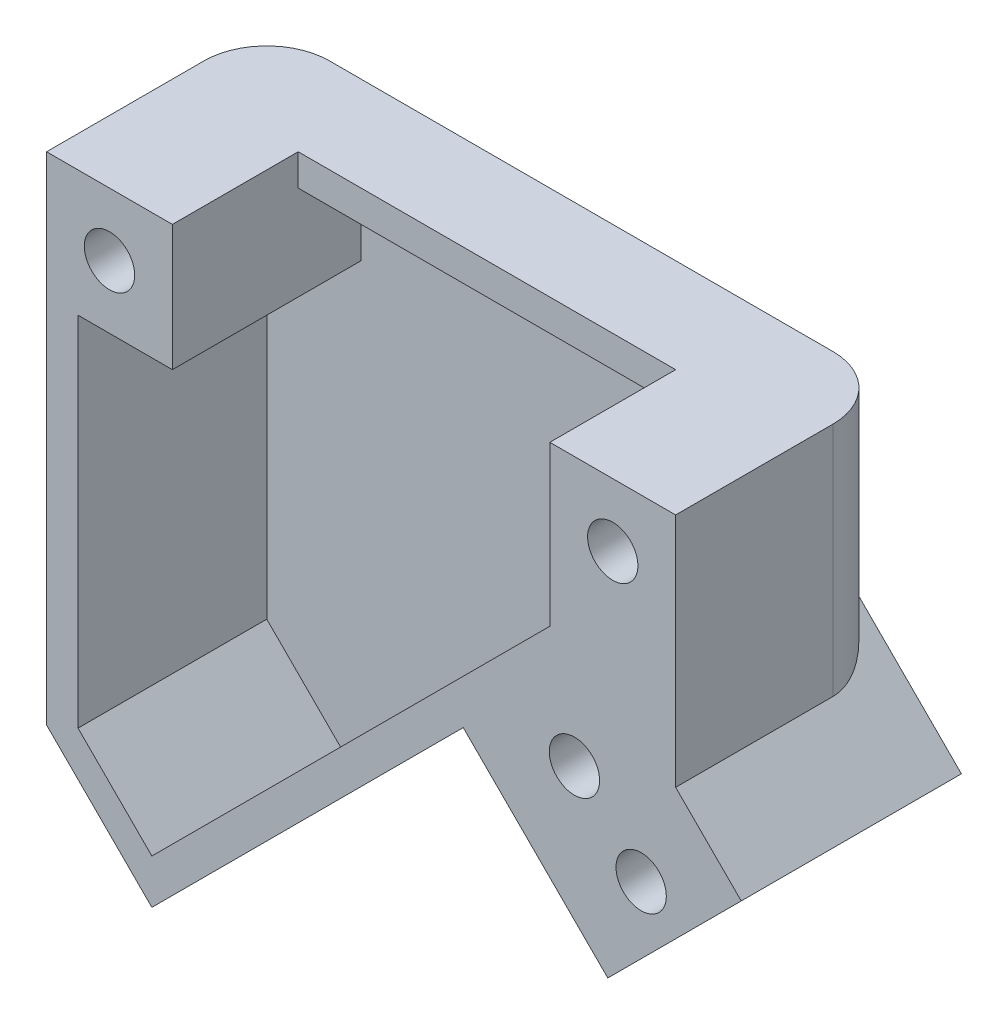
ISO-10303-21;
HEADER;
FILE_DESCRIPTION(('STEP AP214'),'2;1');
FILE_NAME('part.step','',(''),(''),'','','');
FILE_SCHEMA(('AUTOMOTIVE_DESIGN { 1 0 10303 214 1 1 1 1 }'));
ENDSEC;
DATA;
#1=APPLICATION_CONTEXT('core data for automotive mechanical design processes');
#2=APPLICATION_PROTOCOL_DEFINITION('international standard','automotive_design',2000,#1);
#3=PRODUCT_CONTEXT('',#1,'mechanical');
#4=PRODUCT('Part','Part','',(#3));
#5=PRODUCT_RELATED_PRODUCT_CATEGORY('part','',(#4));
#6=PRODUCT_DEFINITION_FORMATION('','',#4);
#7=PRODUCT_DEFINITION_CONTEXT('part definition',#1,'design');
#8=PRODUCT_DEFINITION('design','',#6,#7);
#9=PRODUCT_DEFINITION_SHAPE('','',#8);
#10=(LENGTH_UNIT() NAMED_UNIT(*) SI_UNIT(.MILLI.,.METRE.));
#11=(NAMED_UNIT(*) PLANE_ANGLE_UNIT() SI_UNIT($,.RADIAN.));
#12=(NAMED_UNIT(*) SI_UNIT($,.STERADIAN.) SOLID_ANGLE_UNIT());
#13=UNCERTAINTY_MEASURE_WITH_UNIT(LENGTH_MEASURE(1.E-05),#10,'distance_accuracy_value','');
#14=(GEOMETRIC_REPRESENTATION_CONTEXT(3) GLOBAL_UNCERTAINTY_ASSIGNED_CONTEXT((#13)) GLOBAL_UNIT_ASSIGNED_CONTEXT((#10,
#11,#12)) REPRESENTATION_CONTEXT('',''));
#15=CARTESIAN_POINT('',(0.,0.,0.));
#16=DIRECTION('',(0.,0.,1.));
#17=DIRECTION('',(1.,0.,0.));
#18=AXIS2_PLACEMENT_3D('',#15,#16,#17);
#19=CARTESIAN_POINT('',(0.,0.,7.));
#20=DIRECTION('',(0.,0.,1.));
#21=DIRECTION('',(1.,0.,0.));
#22=AXIS2_PLACEMENT_3D('',#19,#20,#21);
#23=PLANE('',#22);
#24=DIRECTION('',(0.,-1.,0.));
#25=VECTOR('',#24,1.);
#26=CARTESIAN_POINT('',(4.00000000000009,-1.,7.));
#27=LINE('',#26,#25);
#28=CARTESIAN_POINT('',(4.00000000000009,0.,7.));
#29=VERTEX_POINT('',#28);
#30=CARTESIAN_POINT('',(4.00000000000009,-4.,7.));
#31=VERTEX_POINT('',#30);
#32=EDGE_CURVE('E250',#29,#31,#27,.T.);
#33=ORIENTED_EDGE('',*,*,#32,.F.);
#34=DIRECTION('',(-1.,0.,0.));
#35=VECTOR('',#34,1.);
#36=CARTESIAN_POINT('',(0.,0.,7.));
#37=LINE('',#36,#35);
#38=CARTESIAN_POINT('',(0.,0.,7.));
#39=VERTEX_POINT('',#38);
#40=EDGE_CURVE('E282',#29,#39,#37,.T.);
#41=ORIENTED_EDGE('',*,*,#40,.T.);
#42=DIRECTION('',(0.,-1.,0.));
#43=VECTOR('',#42,1.);
#44=CARTESIAN_POINT('',(0.,0.,7.));
#45=LINE('',#44,#43);
#46=CARTESIAN_POINT('',(0.,-15.7842712456693,7.));
#47=VERTEX_POINT('',#46);
#48=EDGE_CURVE('E286',#39,#47,#45,.T.);
#49=ORIENTED_EDGE('',*,*,#48,.T.);
#50=DIRECTION('',(0.707106781186548,-0.707106781186548,0.));
#51=VECTOR('',#50,1.);
#52=CARTESIAN_POINT('',(3.34741725433348,-19.1316885000028,7.));
#53=LINE('',#52,#51);
#54=CARTESIAN_POINT('',(3.34741725433348,-19.1316885000028,7.));
#55=VERTEX_POINT('',#54);
#56=EDGE_CURVE('E288',#47,#55,#53,.T.);
#57=ORIENTED_EDGE('',*,*,#56,.T.);
#58=DIRECTION('',(0.707106781186548,0.707106781186548,0.));
#59=VECTOR('',#58,1.);
#60=CARTESIAN_POINT('',(13.2469121909451,-9.23219356339115,7.));
#61=LINE('',#60,#59);
#62=CARTESIAN_POINT('',(13.2469121909451,-9.23219356339115,7.));
#63=VERTEX_POINT('',#62);
#64=EDGE_CURVE('E290',#55,#63,#61,.T.);
#65=ORIENTED_EDGE('',*,*,#64,.T.);
#66=DIRECTION('',(0.707106781186548,-0.707106781186547,0.));
#67=VECTOR('',#66,1.);
#68=CARTESIAN_POINT('',(13.2469121909451,-9.23219356339115,7.));
#69=LINE('',#68,#67);
#70=CARTESIAN_POINT('',(17.8431062686601,-13.8283876411061,7.));
#71=VERTEX_POINT('',#70);
#72=EDGE_CURVE('E292',#63,#71,#69,.T.);
#73=ORIENTED_EDGE('',*,*,#72,.T.);
#74=DIRECTION('',(0.707106781186548,0.707106781186548,0.));
#75=VECTOR('',#74,1.);
#76=CARTESIAN_POINT('',(17.8431062686601,-13.8283876411061,7.));
#77=LINE('',#76,#75);
#78=CARTESIAN_POINT('',(22.0857469539857,-9.58574695578038,7.));
#79=VERTEX_POINT('',#78);
#80=EDGE_CURVE('E294',#71,#79,#77,.T.);
#81=ORIENTED_EDGE('',*,*,#80,.T.);
#82=DIRECTION('',(-0.707106781186547,0.707106781186547,0.));
#83=VECTOR('',#82,1.);
#84=CARTESIAN_POINT('',(22.0857469539857,-9.58574695578038,7.));
#85=LINE('',#84,#83);
#86=CARTESIAN_POINT('',(19.9999999982053,-7.49999999999991,7.));
#87=VERTEX_POINT('',#86);
#88=EDGE_CURVE('E296',#79,#87,#85,.T.);
#89=ORIENTED_EDGE('',*,*,#88,.T.);
#90=DIRECTION('',(0.,1.,0.));
#91=VECTOR('',#90,1.);
#92=CARTESIAN_POINT('',(19.9999999982053,0.,7.));
#93=LINE('',#92,#91);
#94=CARTESIAN_POINT('',(19.9999999982053,0.,7.));
#95=VERTEX_POINT('',#94);
#96=EDGE_CURVE('E279',#87,#95,#93,.T.);
#97=ORIENTED_EDGE('',*,*,#96,.T.);
#98=CARTESIAN_POINT('',(15.9999999982053,0.,7.));
#99=VERTEX_POINT('',#98);
#100=EDGE_CURVE('E284',#95,#99,#37,.T.);
#101=ORIENTED_EDGE('',*,*,#100,.T.);
#102=DIRECTION('',(0.,1.,0.));
#103=VECTOR('',#102,1.);
#104=CARTESIAN_POINT('',(15.9999999982053,-1.,7.));
#105=LINE('',#104,#103);
#106=CARTESIAN_POINT('',(15.9999999982053,-5.06489219196322,7.));
#107=VERTEX_POINT('',#106);
#108=EDGE_CURVE('E193',#107,#99,#105,.T.);
#109=ORIENTED_EDGE('',*,*,#108,.F.);
#110=DIRECTION('',(0.707106781186548,0.707106781186547,0.));
#111=VECTOR('',#110,1.);
#112=CARTESIAN_POINT('',(15.9999999982053,-5.06489219196322,7.));
#113=LINE('',#112,#111);
#114=CARTESIAN_POINT('',(3.34741725253877,-17.7174749376297,7.));
#115=VERTEX_POINT('',#114);
#116=EDGE_CURVE('E259',#115,#107,#113,.T.);
#117=ORIENTED_EDGE('',*,*,#116,.F.);
#118=DIRECTION('',(0.707106781186548,-0.707106781186548,0.));
#119=VECTOR('',#118,1.);
#120=CARTESIAN_POINT('',(1.00000000000009,-15.3700576850911,7.));
#121=LINE('',#120,#119);
#122=CARTESIAN_POINT('',(1.00000000000009,-15.3700576850911,7.));
#123=VERTEX_POINT('',#122);
#124=EDGE_CURVE('E256',#123,#115,#121,.T.);
#125=ORIENTED_EDGE('',*,*,#124,.F.);
#126=DIRECTION('',(0.,-1.,0.));
#127=VECTOR('',#126,1.);
#128=CARTESIAN_POINT('',(1.00000000000009,-4.,7.));
#129=LINE('',#128,#127);
#130=CARTESIAN_POINT('',(1.00000000000009,-4.,7.));
#131=VERTEX_POINT('',#130);
#132=EDGE_CURVE('E254',#131,#123,#129,.T.);
#133=ORIENTED_EDGE('',*,*,#132,.F.);
#134=DIRECTION('',(-1.,0.,0.));
#135=VECTOR('',#134,1.);
#136=CARTESIAN_POINT('',(4.00000000000009,-4.,7.));
#137=LINE('',#136,#135);
#138=EDGE_CURVE('E252',#31,#131,#137,.T.);
#139=ORIENTED_EDGE('',*,*,#138,.F.);
#140=EDGE_LOOP('',(#33,#41,#49,#57,#65,#73,#81,#89,#97,#101,#109,#117,#125,#133,#139));
#141=FACE_BOUND('',#140,.T.);
#142=CARTESIAN_POINT('',(1.99999999910268,-2.,7.));
#143=DIRECTION('',(0.,0.,1.));
#144=DIRECTION('',(1.,0.,0.));
#145=AXIS2_PLACEMENT_3D('',#142,#143,#144);
#146=CIRCLE('',#145,0.800000000858148);
#147=CARTESIAN_POINT('',(2.79999999996083,-2.,7.));
#148=VERTEX_POINT('',#147);
#149=EDGE_CURVE('E214',#148,#148,#146,.T.);
#150=ORIENTED_EDGE('',*,*,#149,.F.);
#151=EDGE_LOOP('',(#150));
#152=FACE_BOUND('',#151,.T.);
#153=CARTESIAN_POINT('',(18.9037664395431,-10.6464071266634,7.));
#154=DIRECTION('',(0.,0.,1.));
#155=DIRECTION('',(1.,0.,0.));
#156=AXIS2_PLACEMENT_3D('',#153,#154,#155);
#157=CIRCLE('',#156,0.7999999994026);
#158=CARTESIAN_POINT('',(19.7037664389457,-10.6464071266634,7.));
#159=VERTEX_POINT('',#158);
#160=EDGE_CURVE('E226',#159,#159,#157,.T.);
#161=ORIENTED_EDGE('',*,*,#160,.F.);
#162=EDGE_LOOP('',(#161));
#163=FACE_BOUND('',#162,.T.);
#164=CARTESIAN_POINT('',(16.7824460959834,-8.52508678310377,7.));
#165=DIRECTION('',(0.,0.,1.));
#166=DIRECTION('',(1.,0.,0.));
#167=AXIS2_PLACEMENT_3D('',#164,#165,#166);
#168=CIRCLE('',#167,0.799999999402582);
#169=CARTESIAN_POINT('',(17.582446095386,-8.52508678310377,7.));
#170=VERTEX_POINT('',#169);
#171=EDGE_CURVE('E220',#170,#170,#168,.T.);
#172=ORIENTED_EDGE('',*,*,#171,.F.);
#173=EDGE_LOOP('',(#172));
#174=FACE_BOUND('',#173,.T.);
#175=CARTESIAN_POINT('',(17.9999999991027,-2.,7.));
#176=DIRECTION('',(0.,0.,1.));
#177=DIRECTION('',(1.,0.,0.));
#178=AXIS2_PLACEMENT_3D('',#175,#176,#177);
#179=CIRCLE('',#178,0.800000000858149);
#180=CARTESIAN_POINT('',(18.7999999999608,-2.,7.));
#181=VERTEX_POINT('',#180);
#182=EDGE_CURVE('E207',#181,#181,#179,.T.);
#183=ORIENTED_EDGE('',*,*,#182,.F.);
#184=EDGE_LOOP('',(#183));
#185=FACE_BOUND('',#184,.T.);
#186=ADVANCED_FACE('F33',(#141,#152,#163,#174,#185),#23,.T.);
#187=CARTESIAN_POINT('',(0.,0.,0.));
#188=DIRECTION('',(0.,0.,1.));
#189=DIRECTION('',(1.,0.,0.));
#190=AXIS2_PLACEMENT_3D('',#187,#188,#189);
#191=PLANE('',#190);
#192=CARTESIAN_POINT('',(18.9037664395431,-10.6464071266634,0.));
#193=DIRECTION('',(0.,0.,1.));
#194=DIRECTION('',(1.,0.,0.));
#195=AXIS2_PLACEMENT_3D('',#192,#193,#194);
#196=CIRCLE('',#195,0.7999999994026);
#197=CARTESIAN_POINT('',(19.7037664389457,-10.6464071266634,0.));
#198=VERTEX_POINT('',#197);
#199=EDGE_CURVE('E223',#198,#198,#196,.T.);
#200=ORIENTED_EDGE('',*,*,#199,.T.);
#201=EDGE_LOOP('',(#200));
#202=FACE_BOUND('',#201,.T.);
#203=CARTESIAN_POINT('',(16.7824460959834,-8.52508678310377,0.));
#204=DIRECTION('',(0.,0.,1.));
#205=DIRECTION('',(1.,0.,0.));
#206=AXIS2_PLACEMENT_3D('',#203,#204,#205);
#207=CIRCLE('',#206,0.799999999402582);
#208=CARTESIAN_POINT('',(17.582446095386,-8.52508678310377,0.));
#209=VERTEX_POINT('',#208);
#210=EDGE_CURVE('E217',#209,#209,#207,.T.);
#211=ORIENTED_EDGE('',*,*,#210,.T.);
#212=EDGE_LOOP('',(#211));
#213=FACE_BOUND('',#212,.T.);
#214=DIRECTION('',(-1.,0.,0.));
#215=VECTOR('',#214,1.);
#216=CARTESIAN_POINT('',(0.,0.,0.));
#217=LINE('',#216,#215);
#218=CARTESIAN_POINT('',(17.9999999982053,0.,0.));
#219=VERTEX_POINT('',#218);
#220=CARTESIAN_POINT('',(2.,0.,0.));
#221=VERTEX_POINT('',#220);
#222=EDGE_CURVE('E278',#219,#221,#217,.T.);
#223=ORIENTED_EDGE('',*,*,#222,.F.);
#224=DIRECTION('',(0.,1.,0.));
#225=VECTOR('',#224,1.);
#226=CARTESIAN_POINT('',(17.9999999982053,0.,0.));
#227=LINE('',#226,#225);
#228=CARTESIAN_POINT('',(17.9999999982053,-1.19999999914185,0.));
#229=VERTEX_POINT('',#228);
#230=EDGE_CURVE('E350',#219,#229,#227,.F.);
#231=ORIENTED_EDGE('',*,*,#230,.T.);
#232=CARTESIAN_POINT('',(17.9999999991027,-2.,0.));
#233=DIRECTION('',(0.,0.,1.));
#234=DIRECTION('',(1.,0.,0.));
#235=AXIS2_PLACEMENT_3D('',#232,#233,#234);
#236=CIRCLE('',#235,0.800000000858149);
#237=CARTESIAN_POINT('',(17.9999999982053,-2.80000000085815,0.));
#238=VERTEX_POINT('',#237);
#239=EDGE_CURVE('E211',#229,#238,#236,.T.);
#240=ORIENTED_EDGE('',*,*,#239,.T.);
#241=DIRECTION('',(0.,1.,0.));
#242=VECTOR('',#241,1.);
#243=CARTESIAN_POINT('',(17.9999999982053,0.,0.));
#244=LINE('',#243,#242);
#245=CARTESIAN_POINT('',(17.9999999982053,-5.49999999999991,0.));
#246=VERTEX_POINT('',#245);
#247=EDGE_CURVE('E347',#238,#246,#244,.F.);
#248=ORIENTED_EDGE('',*,*,#247,.T.);
#249=DIRECTION('',(-0.707106781186547,0.707106781186547,0.));
#250=VECTOR('',#249,1.);
#251=CARTESIAN_POINT('',(22.0857469539857,-9.58574695578038,0.));
#252=LINE('',#251,#250);
#253=CARTESIAN_POINT('',(22.0857469539857,-9.58574695578038,0.));
#254=VERTEX_POINT('',#253);
#255=EDGE_CURVE('E283',#254,#246,#252,.T.);
#256=ORIENTED_EDGE('',*,*,#255,.F.);
#257=DIRECTION('',(0.707106781186548,0.707106781186548,0.));
#258=VECTOR('',#257,1.);
#259=CARTESIAN_POINT('',(17.8431062686601,-13.8283876411061,0.));
#260=LINE('',#259,#258);
#261=CARTESIAN_POINT('',(17.8431062686601,-13.8283876411061,0.));
#262=VERTEX_POINT('',#261);
#263=EDGE_CURVE('E306',#262,#254,#260,.T.);
#264=ORIENTED_EDGE('',*,*,#263,.F.);
#265=DIRECTION('',(0.707106781186548,-0.707106781186547,0.));
#266=VECTOR('',#265,1.);
#267=CARTESIAN_POINT('',(13.2469121909451,-9.23219356339115,0.));
#268=LINE('',#267,#266);
#269=CARTESIAN_POINT('',(13.2469121909451,-9.23219356339115,0.));
#270=VERTEX_POINT('',#269);
#271=EDGE_CURVE('E303',#270,#262,#268,.T.);
#272=ORIENTED_EDGE('',*,*,#271,.F.);
#273=DIRECTION('',(0.707106781186548,0.707106781186548,0.));
#274=VECTOR('',#273,1.);
#275=CARTESIAN_POINT('',(13.2469121909451,-9.23219356339115,0.));
#276=LINE('',#275,#274);
#277=CARTESIAN_POINT('',(4.76163081670657,-17.7174749376297,0.));
#278=VERTEX_POINT('',#277);
#279=EDGE_CURVE('E301',#278,#270,#276,.T.);
#280=ORIENTED_EDGE('',*,*,#279,.F.);
#281=DIRECTION('',(0.707106781186548,-0.707106781186548,0.));
#282=VECTOR('',#281,1.);
#283=CARTESIAN_POINT('',(-6.47792206046157,-6.47792206046157,0.));
#284=LINE('',#283,#282);
#285=CARTESIAN_POINT('',(2.,-14.9558441209231,0.));
#286=VERTEX_POINT('',#285);
#287=EDGE_CURVE('E345',#278,#286,#284,.F.);
#288=ORIENTED_EDGE('',*,*,#287,.T.);
#289=DIRECTION('',(0.,-1.,0.));
#290=VECTOR('',#289,1.);
#291=CARTESIAN_POINT('',(2.,0.,0.));
#292=LINE('',#291,#290);
#293=CARTESIAN_POINT('',(2.,-2.80000000085815,0.));
#294=VERTEX_POINT('',#293);
#295=EDGE_CURVE('E343',#286,#294,#292,.F.);
#296=ORIENTED_EDGE('',*,*,#295,.T.);
#297=CARTESIAN_POINT('',(1.99999999910268,-2.,0.));
#298=DIRECTION('',(0.,0.,1.));
#299=DIRECTION('',(1.,0.,0.));
#300=AXIS2_PLACEMENT_3D('',#297,#298,#299);
#301=CIRCLE('',#300,0.800000000858148);
#302=CARTESIAN_POINT('',(2.,-1.19999999914185,0.));
#303=VERTEX_POINT('',#302);
#304=EDGE_CURVE('E210',#294,#303,#301,.T.);
#305=ORIENTED_EDGE('',*,*,#304,.T.);
#306=DIRECTION('',(0.,-1.,0.));
#307=VECTOR('',#306,1.);
#308=CARTESIAN_POINT('',(2.,0.,0.));
#309=LINE('',#308,#307);
#310=EDGE_CURVE('E341',#303,#221,#309,.F.);
#311=ORIENTED_EDGE('',*,*,#310,.T.);
#312=EDGE_LOOP('',(#223,#231,#240,#248,#256,#264,#272,#280,#288,#296,#305,#311));
#313=FACE_BOUND('',#312,.T.);
#314=ADVANCED_FACE('F381',(#202,#213,#313),#191,.F.);
#315=CARTESIAN_POINT('',(19.9999999982053,0.,7.));
#316=DIRECTION('',(-1.,0.,0.));
#317=DIRECTION('',(0.,0.,1.));
#318=AXIS2_PLACEMENT_3D('',#315,#316,#317);
#319=PLANE('',#318);
#320=DIRECTION('',(0.,0.,-1.));
#321=VECTOR('',#320,1.);
#322=CARTESIAN_POINT('',(19.9999999982053,-7.49999999999991,7.));
#323=LINE('',#322,#321);
#324=CARTESIAN_POINT('',(19.9999999982053,-7.49999999999991,2.));
#325=VERTEX_POINT('',#324);
#326=EDGE_CURVE('E298',#87,#325,#323,.T.);
#327=ORIENTED_EDGE('',*,*,#326,.T.);
#328=DIRECTION('',(0.,1.,0.));
#329=VECTOR('',#328,1.);
#330=CARTESIAN_POINT('',(19.9999999982053,0.,2.));
#331=LINE('',#330,#329);
#332=CARTESIAN_POINT('',(19.9999999982053,0.,2.));
#333=VERTEX_POINT('',#332);
#334=EDGE_CURVE('E334',#325,#333,#331,.T.);
#335=ORIENTED_EDGE('',*,*,#334,.T.);
#336=DIRECTION('',(0.,0.,-1.));
#337=VECTOR('',#336,1.);
#338=CARTESIAN_POINT('',(19.9999999982053,0.,7.));
#339=LINE('',#338,#337);
#340=EDGE_CURVE('E328',#95,#333,#339,.T.);
#341=ORIENTED_EDGE('',*,*,#340,.F.);
#342=ORIENTED_EDGE('',*,*,#96,.F.);
#343=EDGE_LOOP('',(#327,#335,#341,#342));
#344=FACE_BOUND('',#343,.T.);
#345=ADVANCED_FACE('F370',(#344),#319,.F.);
#346=CARTESIAN_POINT('',(0.,0.,7.));
#347=DIRECTION('',(0.,-1.,0.));
#348=DIRECTION('',(0.,0.,-1.));
#349=AXIS2_PLACEMENT_3D('',#346,#347,#348);
#350=PLANE('',#349);
#351=ORIENTED_EDGE('',*,*,#40,.F.);
#352=DIRECTION('',(0.,0.,1.));
#353=VECTOR('',#352,1.);
#354=CARTESIAN_POINT('',(4.00000000000009,0.,3.));
#355=LINE('',#354,#353);
#356=CARTESIAN_POINT('',(4.00000000000009,0.,3.));
#357=VERTEX_POINT('',#356);
#358=EDGE_CURVE('E196',#357,#29,#355,.T.);
#359=ORIENTED_EDGE('',*,*,#358,.F.);
#360=DIRECTION('',(-1.,0.,0.));
#361=VECTOR('',#360,1.);
#362=CARTESIAN_POINT('',(4.00000000000009,0.,3.));
#363=LINE('',#362,#361);
#364=CARTESIAN_POINT('',(15.9999999982053,0.,3.));
#365=VERTEX_POINT('',#364);
#366=EDGE_CURVE('E183',#365,#357,#363,.T.);
#367=ORIENTED_EDGE('',*,*,#366,.F.);
#368=DIRECTION('',(0.,0.,1.));
#369=VECTOR('',#368,1.);
#370=CARTESIAN_POINT('',(15.9999999982053,0.,3.));
#371=LINE('',#370,#369);
#372=EDGE_CURVE('E189',#365,#99,#371,.T.);
#373=ORIENTED_EDGE('',*,*,#372,.T.);
#374=ORIENTED_EDGE('',*,*,#100,.F.);
#375=ORIENTED_EDGE('',*,*,#340,.T.);
#376=CARTESIAN_POINT('',(17.9999999982053,0.,2.));
#377=DIRECTION('',(0.,-1.,0.));
#378=DIRECTION('',(0.,0.,-1.));
#379=AXIS2_PLACEMENT_3D('',#376,#377,#378);
#380=CIRCLE('',#379,2.);
#381=EDGE_CURVE('E339',#333,#219,#380,.F.);
#382=ORIENTED_EDGE('',*,*,#381,.T.);
#383=ORIENTED_EDGE('',*,*,#222,.T.);
#384=CARTESIAN_POINT('',(2.,0.,2.));
#385=DIRECTION('',(0.,-1.,0.));
#386=DIRECTION('',(0.,0.,-1.));
#387=AXIS2_PLACEMENT_3D('',#384,#385,#386);
#388=CIRCLE('',#387,2.);
#389=CARTESIAN_POINT('',(0.,0.,2.));
#390=VERTEX_POINT('',#389);
#391=EDGE_CURVE('E337',#221,#390,#388,.F.);
#392=ORIENTED_EDGE('',*,*,#391,.T.);
#393=DIRECTION('',(0.,0.,-1.));
#394=VECTOR('',#393,1.);
#395=CARTESIAN_POINT('',(0.,0.,7.));
#396=LINE('',#395,#394);
#397=EDGE_CURVE('E325',#39,#390,#396,.T.);
#398=ORIENTED_EDGE('',*,*,#397,.F.);
#399=EDGE_LOOP('',(#351,#359,#367,#373,#374,#375,#382,#383,#392,#398));
#400=FACE_BOUND('',#399,.T.);
#401=ADVANCED_FACE('F200',(#400),#350,.F.);
#402=CARTESIAN_POINT('',(0.,0.,7.));
#403=DIRECTION('',(1.,0.,0.));
#404=DIRECTION('',(0.,0.,-1.));
#405=AXIS2_PLACEMENT_3D('',#402,#403,#404);
#406=PLANE('',#405);
#407=ORIENTED_EDGE('',*,*,#397,.T.);
#408=DIRECTION('',(0.,-1.,0.));
#409=VECTOR('',#408,1.);
#410=CARTESIAN_POINT('',(0.,0.,2.));
#411=LINE('',#410,#409);
#412=CARTESIAN_POINT('',(0.,-15.7842712456693,2.));
#413=VERTEX_POINT('',#412);
#414=EDGE_CURVE('E442',#390,#413,#411,.T.);
#415=ORIENTED_EDGE('',*,*,#414,.T.);
#416=DIRECTION('',(0.,0.,-1.));
#417=VECTOR('',#416,1.);
#418=CARTESIAN_POINT('',(0.,-15.7842712456693,7.));
#419=LINE('',#418,#417);
#420=EDGE_CURVE('E322',#47,#413,#419,.T.);
#421=ORIENTED_EDGE('',*,*,#420,.F.);
#422=ORIENTED_EDGE('',*,*,#48,.F.);
#423=EDGE_LOOP('',(#407,#415,#421,#422));
#424=FACE_BOUND('',#423,.T.);
#425=ADVANCED_FACE('F412',(#424),#406,.F.);
#426=CARTESIAN_POINT('',(3.34741725433348,-19.1316885000028,7.));
#427=DIRECTION('',(0.707106781186547,0.707106781186547,0.));
#428=DIRECTION('',(-0.707106781186548,0.707106781186548,0.));
#429=AXIS2_PLACEMENT_3D('',#426,#427,#428);
#430=PLANE('',#429);
#431=ORIENTED_EDGE('',*,*,#420,.T.);
#432=DIRECTION('',(0.707106781186548,-0.707106781186548,0.));
#433=VECTOR('',#432,1.);
#434=CARTESIAN_POINT('',(3.34741725433348,-19.1316885000028,2.));
#435=LINE('',#434,#433);
#436=CARTESIAN_POINT('',(3.34741725433348,-19.1316885000028,2.));
#437=VERTEX_POINT('',#436);
#438=EDGE_CURVE('E359',#413,#437,#435,.T.);
#439=ORIENTED_EDGE('',*,*,#438,.T.);
#440=DIRECTION('',(0.,0.,-1.));
#441=VECTOR('',#440,1.);
#442=CARTESIAN_POINT('',(3.34741725433348,-19.1316885000028,7.));
#443=LINE('',#442,#441);
#444=EDGE_CURVE('E319',#55,#437,#443,.T.);
#445=ORIENTED_EDGE('',*,*,#444,.F.);
#446=ORIENTED_EDGE('',*,*,#56,.F.);
#447=EDGE_LOOP('',(#431,#439,#445,#446));
#448=FACE_BOUND('',#447,.T.);
#449=ADVANCED_FACE('F408',(#448),#430,.F.);
#450=CARTESIAN_POINT('',(13.2469121909451,-9.23219356339115,7.));
#451=DIRECTION('',(-0.707106781186547,0.707106781186548,0.));
#452=DIRECTION('',(-0.707106781186548,-0.707106781186547,0.));
#453=AXIS2_PLACEMENT_3D('',#450,#451,#452);
#454=PLANE('',#453);
#455=ORIENTED_EDGE('',*,*,#444,.T.);
#456=CARTESIAN_POINT('',(4.76163081670658,-17.7174749376297,2.));
#457=DIRECTION('',(-0.707106781186547,0.707106781186548,0.));
#458=DIRECTION('',(-0.707106781186548,-0.707106781186547,0.));
#459=AXIS2_PLACEMENT_3D('',#456,#457,#458);
#460=CIRCLE('',#459,2.);
#461=EDGE_CURVE('E58',#437,#278,#460,.F.);
#462=ORIENTED_EDGE('',*,*,#461,.T.);
#463=ORIENTED_EDGE('',*,*,#279,.T.);
#464=DIRECTION('',(0.,0.,-1.));
#465=VECTOR('',#464,1.);
#466=CARTESIAN_POINT('',(13.2469121909451,-9.23219356339115,7.));
#467=LINE('',#466,#465);
#468=EDGE_CURVE('E316',#63,#270,#467,.T.);
#469=ORIENTED_EDGE('',*,*,#468,.F.);
#470=ORIENTED_EDGE('',*,*,#64,.F.);
#471=EDGE_LOOP('',(#455,#462,#463,#469,#470));
#472=FACE_BOUND('',#471,.T.);
#473=ADVANCED_FACE('F404',(#472),#454,.F.);
#474=CARTESIAN_POINT('',(13.2469121909451,-9.23219356339115,7.));
#475=DIRECTION('',(0.707106781186547,0.707106781186548,0.));
#476=DIRECTION('',(-0.707106781186548,0.707106781186547,0.));
#477=AXIS2_PLACEMENT_3D('',#474,#475,#476);
#478=PLANE('',#477);
#479=ORIENTED_EDGE('',*,*,#468,.T.);
#480=ORIENTED_EDGE('',*,*,#271,.T.);
#481=DIRECTION('',(0.,0.,-1.));
#482=VECTOR('',#481,1.);
#483=CARTESIAN_POINT('',(17.8431062686601,-13.8283876411061,7.));
#484=LINE('',#483,#482);
#485=EDGE_CURVE('E314',#71,#262,#484,.T.);
#486=ORIENTED_EDGE('',*,*,#485,.F.);
#487=ORIENTED_EDGE('',*,*,#72,.F.);
#488=EDGE_LOOP('',(#479,#480,#486,#487));
#489=FACE_BOUND('',#488,.T.);
#490=ADVANCED_FACE('F400',(#489),#478,.F.);
#491=CARTESIAN_POINT('',(17.8431062686601,-13.8283876411061,7.));
#492=DIRECTION('',(-0.707106781186548,0.707106781186548,0.));
#493=DIRECTION('',(-0.707106781186548,-0.707106781186548,0.));
#494=AXIS2_PLACEMENT_3D('',#491,#492,#493);
#495=PLANE('',#494);
#496=ORIENTED_EDGE('',*,*,#485,.T.);
#497=ORIENTED_EDGE('',*,*,#263,.T.);
#498=DIRECTION('',(0.,0.,-1.));
#499=VECTOR('',#498,1.);
#500=CARTESIAN_POINT('',(22.0857469539857,-9.58574695578038,7.));
#501=LINE('',#500,#499);
#502=EDGE_CURVE('E312',#79,#254,#501,.T.);
#503=ORIENTED_EDGE('',*,*,#502,.F.);
#504=ORIENTED_EDGE('',*,*,#80,.F.);
#505=EDGE_LOOP('',(#496,#497,#503,#504));
#506=FACE_BOUND('',#505,.T.);
#507=ADVANCED_FACE('F396',(#506),#495,.F.);
#508=CARTESIAN_POINT('',(22.0857469539857,-9.58574695578038,7.));
#509=DIRECTION('',(-0.707106781186548,-0.707106781186548,0.));
#510=DIRECTION('',(0.707106781186548,-0.707106781186548,0.));
#511=AXIS2_PLACEMENT_3D('',#508,#509,#510);
#512=PLANE('',#511);
#513=ORIENTED_EDGE('',*,*,#502,.T.);
#514=ORIENTED_EDGE('',*,*,#255,.T.);
#515=CARTESIAN_POINT('',(17.9999999982053,-5.49999999999991,2.));
#516=DIRECTION('',(-0.707106781186548,-0.707106781186548,0.));
#517=DIRECTION('',(-0.707106781186548,0.707106781186548,0.));
#518=AXIS2_PLACEMENT_3D('',#515,#516,#517);
#519=ELLIPSE('',#518,2.82842712474619,2.);
#520=EDGE_CURVE('E11',#246,#325,#519,.T.);
#521=ORIENTED_EDGE('',*,*,#520,.T.);
#522=ORIENTED_EDGE('',*,*,#326,.F.);
#523=ORIENTED_EDGE('',*,*,#88,.F.);
#524=EDGE_LOOP('',(#513,#514,#521,#522,#523));
#525=FACE_BOUND('',#524,.T.);
#526=ADVANCED_FACE('F393',(#525),#512,.F.);
#527=CARTESIAN_POINT('',(15.9999999982053,-1.,7.));
#528=DIRECTION('',(-1.,0.,0.));
#529=DIRECTION('',(0.,0.,1.));
#530=AXIS2_PLACEMENT_3D('',#527,#528,#529);
#531=PLANE('',#530);
#532=ORIENTED_EDGE('',*,*,#108,.T.);
#533=ORIENTED_EDGE('',*,*,#372,.F.);
#534=DIRECTION('',(0.,1.,0.));
#535=VECTOR('',#534,1.);
#536=CARTESIAN_POINT('',(15.9999999982053,0.,3.));
#537=LINE('',#536,#535);
#538=CARTESIAN_POINT('',(15.9999999982053,-1.,3.));
#539=VERTEX_POINT('',#538);
#540=EDGE_CURVE('E179',#539,#365,#537,.T.);
#541=ORIENTED_EDGE('',*,*,#540,.F.);
#542=DIRECTION('',(0.,0.,-1.));
#543=VECTOR('',#542,1.);
#544=CARTESIAN_POINT('',(15.9999999982053,-1.,7.));
#545=LINE('',#544,#543);
#546=CARTESIAN_POINT('',(15.9999999982053,-1.,1.));
#547=VERTEX_POINT('',#546);
#548=EDGE_CURVE('E276',#539,#547,#545,.T.);
#549=ORIENTED_EDGE('',*,*,#548,.T.);
#550=DIRECTION('',(0.,1.,0.));
#551=VECTOR('',#550,1.);
#552=CARTESIAN_POINT('',(15.9999999982053,-1.,1.));
#553=LINE('',#552,#551);
#554=CARTESIAN_POINT('',(15.9999999982053,-5.06489219196322,1.));
#555=VERTEX_POINT('',#554);
#556=EDGE_CURVE('E246',#555,#547,#553,.T.);
#557=ORIENTED_EDGE('',*,*,#556,.F.);
#558=DIRECTION('',(0.,0.,-1.));
#559=VECTOR('',#558,1.);
#560=CARTESIAN_POINT('',(15.9999999982053,-5.06489219196322,7.));
#561=LINE('',#560,#559);
#562=EDGE_CURVE('E261',#107,#555,#561,.T.);
#563=ORIENTED_EDGE('',*,*,#562,.F.);
#564=EDGE_LOOP('',(#532,#533,#541,#549,#557,#563));
#565=FACE_BOUND('',#564,.T.);
#566=ADVANCED_FACE('F190',(#565),#531,.T.);
#567=CARTESIAN_POINT('',(4.00000000000009,-1.,7.));
#568=DIRECTION('',(0.,-1.,0.));
#569=DIRECTION('',(0.,0.,-1.));
#570=AXIS2_PLACEMENT_3D('',#567,#568,#569);
#571=PLANE('',#570);
#572=DIRECTION('',(1.,0.,0.));
#573=VECTOR('',#572,1.);
#574=CARTESIAN_POINT('',(4.00000000000009,-1.,3.));
#575=LINE('',#574,#573);
#576=CARTESIAN_POINT('',(4.00000000000009,-1.,3.));
#577=VERTEX_POINT('',#576);
#578=EDGE_CURVE('E184',#577,#539,#575,.T.);
#579=ORIENTED_EDGE('',*,*,#578,.F.);
#580=DIRECTION('',(0.,0.,-1.));
#581=VECTOR('',#580,1.);
#582=CARTESIAN_POINT('',(4.00000000000009,-1.,7.));
#583=LINE('',#582,#581);
#584=CARTESIAN_POINT('',(4.00000000000009,-1.,1.));
#585=VERTEX_POINT('',#584);
#586=EDGE_CURVE('E274',#577,#585,#583,.T.);
#587=ORIENTED_EDGE('',*,*,#586,.T.);
#588=DIRECTION('',(-1.,0.,0.));
#589=VECTOR('',#588,1.);
#590=CARTESIAN_POINT('',(4.00000000000009,-1.,1.));
#591=LINE('',#590,#589);
#592=EDGE_CURVE('E243',#547,#585,#591,.T.);
#593=ORIENTED_EDGE('',*,*,#592,.F.);
#594=ORIENTED_EDGE('',*,*,#548,.F.);
#595=EDGE_LOOP('',(#579,#587,#593,#594));
#596=FACE_BOUND('',#595,.T.);
#597=ADVANCED_FACE('F457',(#596),#571,.T.);
#598=CARTESIAN_POINT('',(4.00000000000009,-1.,7.));
#599=DIRECTION('',(1.,0.,0.));
#600=DIRECTION('',(0.,0.,-1.));
#601=AXIS2_PLACEMENT_3D('',#598,#599,#600);
#602=PLANE('',#601);
#603=ORIENTED_EDGE('',*,*,#586,.F.);
#604=DIRECTION('',(0.,-1.,0.));
#605=VECTOR('',#604,1.);
#606=CARTESIAN_POINT('',(4.00000000000009,-4.,3.));
#607=LINE('',#606,#605);
#608=EDGE_CURVE('E50',#357,#577,#607,.T.);
#609=ORIENTED_EDGE('',*,*,#608,.F.);
#610=ORIENTED_EDGE('',*,*,#358,.T.);
#611=ORIENTED_EDGE('',*,*,#32,.T.);
#612=DIRECTION('',(0.,0.,-1.));
#613=VECTOR('',#612,1.);
#614=CARTESIAN_POINT('',(4.00000000000009,-4.,7.));
#615=LINE('',#614,#613);
#616=CARTESIAN_POINT('',(4.00000000000009,-4.,1.));
#617=VERTEX_POINT('',#616);
#618=EDGE_CURVE('E272',#31,#617,#615,.T.);
#619=ORIENTED_EDGE('',*,*,#618,.T.);
#620=DIRECTION('',(0.,-1.,0.));
#621=VECTOR('',#620,1.);
#622=CARTESIAN_POINT('',(4.00000000000009,-1.,1.));
#623=LINE('',#622,#621);
#624=EDGE_CURVE('E240',#585,#617,#623,.T.);
#625=ORIENTED_EDGE('',*,*,#624,.F.);
#626=EDGE_LOOP('',(#603,#609,#610,#611,#619,#625));
#627=FACE_BOUND('',#626,.T.);
#628=ADVANCED_FACE('F453',(#627),#602,.T.);
#629=CARTESIAN_POINT('',(4.00000000000009,-4.,7.));
#630=DIRECTION('',(0.,-1.,0.));
#631=DIRECTION('',(0.,0.,-1.));
#632=AXIS2_PLACEMENT_3D('',#629,#630,#631);
#633=PLANE('',#632);
#634=DIRECTION('',(-1.,0.,0.));
#635=VECTOR('',#634,1.);
#636=CARTESIAN_POINT('',(4.00000000000009,-4.,1.));
#637=LINE('',#636,#635);
#638=CARTESIAN_POINT('',(1.00000000000009,-4.,1.));
#639=VERTEX_POINT('',#638);
#640=EDGE_CURVE('E237',#617,#639,#637,.T.);
#641=ORIENTED_EDGE('',*,*,#640,.F.);
#642=ORIENTED_EDGE('',*,*,#618,.F.);
#643=ORIENTED_EDGE('',*,*,#138,.T.);
#644=DIRECTION('',(0.,0.,-1.));
#645=VECTOR('',#644,1.);
#646=CARTESIAN_POINT('',(1.00000000000009,-4.,7.));
#647=LINE('',#646,#645);
#648=EDGE_CURVE('E269',#131,#639,#647,.T.);
#649=ORIENTED_EDGE('',*,*,#648,.T.);
#650=EDGE_LOOP('',(#641,#642,#643,#649));
#651=FACE_BOUND('',#650,.T.);
#652=ADVANCED_FACE('F515',(#651),#633,.T.);
#653=CARTESIAN_POINT('',(1.00000000000009,-4.,7.));
#654=DIRECTION('',(1.,0.,0.));
#655=DIRECTION('',(0.,0.,-1.));
#656=AXIS2_PLACEMENT_3D('',#653,#654,#655);
#657=PLANE('',#656);
#658=DIRECTION('',(0.,-1.,0.));
#659=VECTOR('',#658,1.);
#660=CARTESIAN_POINT('',(1.00000000000009,-4.,1.));
#661=LINE('',#660,#659);
#662=CARTESIAN_POINT('',(1.00000000000009,-15.3700576850911,1.));
#663=VERTEX_POINT('',#662);
#664=EDGE_CURVE('E234',#639,#663,#661,.T.);
#665=ORIENTED_EDGE('',*,*,#664,.F.);
#666=ORIENTED_EDGE('',*,*,#648,.F.);
#667=ORIENTED_EDGE('',*,*,#132,.T.);
#668=DIRECTION('',(0.,0.,-1.));
#669=VECTOR('',#668,1.);
#670=CARTESIAN_POINT('',(1.00000000000009,-15.3700576850911,7.));
#671=LINE('',#670,#669);
#672=EDGE_CURVE('E266',#123,#663,#671,.T.);
#673=ORIENTED_EDGE('',*,*,#672,.T.);
#674=EDGE_LOOP('',(#665,#666,#667,#673));
#675=FACE_BOUND('',#674,.T.);
#676=ADVANCED_FACE('F512',(#675),#657,.T.);
#677=CARTESIAN_POINT('',(1.00000000000009,-15.3700576850911,7.));
#678=DIRECTION('',(0.707106781186547,0.707106781186547,0.));
#679=DIRECTION('',(-0.707106781186548,0.707106781186548,0.));
#680=AXIS2_PLACEMENT_3D('',#677,#678,#679);
#681=PLANE('',#680);
#682=DIRECTION('',(0.707106781186548,-0.707106781186548,0.));
#683=VECTOR('',#682,1.);
#684=CARTESIAN_POINT('',(1.00000000000009,-15.3700576850911,1.));
#685=LINE('',#684,#683);
#686=CARTESIAN_POINT('',(3.34741725253877,-17.7174749376297,1.));
#687=VERTEX_POINT('',#686);
#688=EDGE_CURVE('E229',#663,#687,#685,.T.);
#689=ORIENTED_EDGE('',*,*,#688,.F.);
#690=ORIENTED_EDGE('',*,*,#672,.F.);
#691=ORIENTED_EDGE('',*,*,#124,.T.);
#692=DIRECTION('',(0.,0.,-1.));
#693=VECTOR('',#692,1.);
#694=CARTESIAN_POINT('',(3.34741725253877,-17.7174749376297,7.));
#695=LINE('',#694,#693);
#696=EDGE_CURVE('E263',#115,#687,#695,.T.);
#697=ORIENTED_EDGE('',*,*,#696,.T.);
#698=EDGE_LOOP('',(#689,#690,#691,#697));
#699=FACE_BOUND('',#698,.T.);
#700=ADVANCED_FACE('F464',(#699),#681,.T.);
#701=CARTESIAN_POINT('',(15.9999999982053,-5.06489219196322,7.));
#702=DIRECTION('',(-0.707106781186547,0.707106781186548,0.));
#703=DIRECTION('',(-0.707106781186548,-0.707106781186547,0.));
#704=AXIS2_PLACEMENT_3D('',#701,#702,#703);
#705=PLANE('',#704);
#706=DIRECTION('',(0.707106781186548,0.707106781186547,0.));
#707=VECTOR('',#706,1.);
#708=CARTESIAN_POINT('',(15.9999999982053,-5.06489219196322,1.));
#709=LINE('',#708,#707);
#710=EDGE_CURVE('E331',#687,#555,#709,.T.);
#711=ORIENTED_EDGE('',*,*,#710,.F.);
#712=ORIENTED_EDGE('',*,*,#696,.F.);
#713=ORIENTED_EDGE('',*,*,#116,.T.);
#714=ORIENTED_EDGE('',*,*,#562,.T.);
#715=EDGE_LOOP('',(#711,#712,#713,#714));
#716=FACE_BOUND('',#715,.T.);
#717=ADVANCED_FACE('F462',(#716),#705,.T.);
#718=CARTESIAN_POINT('',(0.,0.,1.));
#719=DIRECTION('',(0.,0.,1.));
#720=DIRECTION('',(1.,0.,0.));
#721=AXIS2_PLACEMENT_3D('',#718,#719,#720);
#722=PLANE('',#721);
#723=ORIENTED_EDGE('',*,*,#710,.T.);
#724=ORIENTED_EDGE('',*,*,#556,.T.);
#725=ORIENTED_EDGE('',*,*,#592,.T.);
#726=ORIENTED_EDGE('',*,*,#624,.T.);
#727=ORIENTED_EDGE('',*,*,#640,.T.);
#728=ORIENTED_EDGE('',*,*,#664,.T.);
#729=ORIENTED_EDGE('',*,*,#688,.T.);
#730=EDGE_LOOP('',(#723,#724,#725,#726,#727,#728,#729));
#731=FACE_BOUND('',#730,.T.);
#732=ADVANCED_FACE('F460',(#731),#722,.T.);
#733=CARTESIAN_POINT('',(18.9037664395431,-10.6464071266634,7.));
#734=DIRECTION('',(0.,0.,-1.));
#735=DIRECTION('',(-1.,0.,0.));
#736=AXIS2_PLACEMENT_3D('',#733,#734,#735);
#737=CYLINDRICAL_SURFACE('',#736,0.7999999994026);
#738=ORIENTED_EDGE('',*,*,#160,.T.);
#739=EDGE_LOOP('',(#738));
#740=FACE_BOUND('',#739,.T.);
#741=ORIENTED_EDGE('',*,*,#199,.F.);
#742=EDGE_LOOP('',(#741));
#743=FACE_BOUND('',#742,.T.);
#744=ADVANCED_FACE('F488',(#740,#743),#737,.F.);
#745=CARTESIAN_POINT('',(16.7824460959834,-8.52508678310377,7.));
#746=DIRECTION('',(0.,0.,-1.));
#747=DIRECTION('',(-1.,0.,0.));
#748=AXIS2_PLACEMENT_3D('',#745,#746,#747);
#749=CYLINDRICAL_SURFACE('',#748,0.799999999402582);
#750=ORIENTED_EDGE('',*,*,#171,.T.);
#751=EDGE_LOOP('',(#750));
#752=FACE_BOUND('',#751,.T.);
#753=ORIENTED_EDGE('',*,*,#210,.F.);
#754=EDGE_LOOP('',(#753));
#755=FACE_BOUND('',#754,.T.);
#756=ADVANCED_FACE('F481',(#752,#755),#749,.F.);
#757=CARTESIAN_POINT('',(1.99999999910268,-2.,7.));
#758=DIRECTION('',(0.,0.,-1.));
#759=DIRECTION('',(-1.,0.,0.));
#760=AXIS2_PLACEMENT_3D('',#757,#758,#759);
#761=CYLINDRICAL_SURFACE('',#760,0.800000000858148);
#762=ORIENTED_EDGE('',*,*,#149,.T.);
#763=EDGE_LOOP('',(#762));
#764=FACE_BOUND('',#763,.T.);
#765=ORIENTED_EDGE('',*,*,#304,.F.);
#766=CARTESIAN_POINT('',(2.,-2.80000000085815,0.));
#767=CARTESIAN_POINT('',(1.97840168320992,-2.80000074759948,-1.8616177834327E-06));
#768=CARTESIAN_POINT('',(1.95681447554537,-2.79912475815127,0.000350269846283957));
#769=CARTESIAN_POINT('',(1.91380950582998,-2.79563599246404,0.00174254682886074));
#770=CARTESIAN_POINT('',(1.892391695487,-2.79302373069704,0.00278248854298549));
#771=CARTESIAN_POINT('',(1.82877698361939,-2.78263667028574,0.00689257695981547));
#772=CARTESIAN_POINT('',(1.78703043047776,-2.77231125643785,0.0109533376511652));
#773=CARTESIAN_POINT('',(1.70603033102461,-2.74525673595522,0.0213001228345986));
#774=CARTESIAN_POINT('',(1.66677511994008,-2.72853195918873,0.0275846424949686));
#775=CARTESIAN_POINT('',(1.59161223891506,-2.68921650239467,0.0417651951590772));
#776=CARTESIAN_POINT('',(1.55570699866712,-2.66662160910903,0.0496623847769886));
#777=CARTESIAN_POINT('',(1.48659686091573,-2.61510432277205,0.0666769198659884));
#778=CARTESIAN_POINT('',(1.45357122046222,-2.58595410004673,0.0758318231359766));
#779=CARTESIAN_POINT('',(1.39272712415713,-2.5226362213227,0.0941587129269051));
#780=CARTESIAN_POINT('',(1.36491063724387,-2.48846667681028,0.103330704589263));
#781=CARTESIAN_POINT('',(1.31404985827523,-2.41422839936555,0.12110892087838));
#782=CARTESIAN_POINT('',(1.29127354006298,-2.37396460898634,0.129671705413539));
#783=CARTESIAN_POINT('',(1.25289781643774,-2.28978457099246,0.144665540124021));
#784=CARTESIAN_POINT('',(1.23729486104771,-2.24587014275082,0.151097644295927));
#785=CARTESIAN_POINT('',(1.21444058124398,-2.15771551553313,0.160694521269066));
#786=CARTESIAN_POINT('',(1.20684256826811,-2.11358042522113,0.163994251320971));
#787=CARTESIAN_POINT('',(1.19913081795822,-2.02454693562553,0.167343982744288));
#788=CARTESIAN_POINT('',(1.19901355507612,-1.97964890588177,0.167395514935013));
#789=CARTESIAN_POINT('',(1.20600427891021,-1.89369697889233,0.164357987303992));
#790=CARTESIAN_POINT('',(1.21260998302421,-1.85259301434527,0.16148725143786));
#791=CARTESIAN_POINT('',(1.23202146626958,-1.77213550690237,0.153295159942804));
#792=CARTESIAN_POINT('',(1.24482822191642,-1.73278224076524,0.147973418346275));
#793=CARTESIAN_POINT('',(1.27652201932521,-1.65599305383924,0.135362091181604));
#794=CARTESIAN_POINT('',(1.29552783805936,-1.61861266776567,0.128034554621998));
#795=CARTESIAN_POINT('',(1.3389972100925,-1.54743399582817,0.112247616167802));
#796=CARTESIAN_POINT('',(1.36346286543615,-1.51363709702429,0.10378777883928));
#797=CARTESIAN_POINT('',(1.41937795797775,-1.4478380885571,0.0858935902990734));
#798=CARTESIAN_POINT('',(1.4512208449268,-1.41617620839679,0.0764344376148445));
#799=CARTESIAN_POINT('',(1.51987045256664,-1.35852917762326,0.0581617176752619));
#800=CARTESIAN_POINT('',(1.55667873004881,-1.33254581410801,0.0493483542359977));
#801=CARTESIAN_POINT('',(1.63518762990039,-1.28654113439417,0.0331370479550238));
#802=CARTESIAN_POINT('',(1.67697214737318,-1.2666510371025,0.0257713391251875));
#803=CARTESIAN_POINT('',(1.76364428430654,-1.23431925919945,0.0135355321907341));
#804=CARTESIAN_POINT('',(1.80852701358873,-1.22186612707263,0.00866159889896343));
#805=CARTESIAN_POINT('',(1.87821620826241,-1.20894554362962,0.00356516198483684));
#806=CARTESIAN_POINT('',(1.90244118976434,-1.20559469549053,0.00223291965738355));
#807=CARTESIAN_POINT('',(1.9511059310083,-1.20112204013449,0.000449035617343295));
#808=CARTESIAN_POINT('',(1.97554547847986,-1.19999823510725,-3.39533952070058E-06));
#809=CARTESIAN_POINT('',(2.,-1.19999999914185,0.));
#810=B_SPLINE_CURVE_WITH_KNOTS('',3,(#766,#767,#768,#769,#770,#771,#772,#773,#774,#775,#776,
#777,#778,#779,#780,#781,#782,#783,#784,#785,#786,#787,#788,#789,#790,#791,#792,#793,#794,#795,
#796,#797,#798,#799,#800,#801,#802,#803,#804,#805,#806,#807,#808,#809),.UNSPECIFIED.,.F.,.F.,(4,
2,2,2,2,2,2,2,2,2,2,2,2,2,2,2,2,2,2,2,2,4),(0.,0.0647526799849387,0.12948618175708,
0.258395675218454,0.387218101118051,0.516133245598235,0.650519182132566,0.784955811338661,
0.925384653489114,1.0657439247526,1.19973726592622,1.33366745788986,1.45827660508721,
1.58290538159291,1.71007812785617,1.83729992053175,1.97434772779866,2.11143860375847,
2.25130229884928,2.3909500713413,2.46432063165341,2.537625343696),.UNSPECIFIED.);
#811=EDGE_CURVE('E43',#294,#303,#810,.T.);
#812=ORIENTED_EDGE('',*,*,#811,.T.);
#813=EDGE_LOOP('',(#765,#812));
#814=FACE_BOUND('',#813,.T.);
#815=ADVANCED_FACE('F476',(#764,#814),#761,.F.);
#816=CARTESIAN_POINT('',(17.9999999991027,-2.,7.));
#817=DIRECTION('',(0.,0.,-1.));
#818=DIRECTION('',(-1.,0.,0.));
#819=AXIS2_PLACEMENT_3D('',#816,#817,#818);
#820=CYLINDRICAL_SURFACE('',#819,0.800000000858149);
#821=ORIENTED_EDGE('',*,*,#182,.T.);
#822=EDGE_LOOP('',(#821));
#823=FACE_BOUND('',#822,.T.);
#824=ORIENTED_EDGE('',*,*,#239,.F.);
#825=CARTESIAN_POINT('',(17.9999999982053,-1.19999999914185,0.));
#826=CARTESIAN_POINT('',(18.0215983149954,-1.19999925240052,-1.8616177835823E-06));
#827=CARTESIAN_POINT('',(18.0431855226599,-1.20087524184873,0.000350269846283851));
#828=CARTESIAN_POINT('',(18.0861904923753,-1.20436400753595,0.00174254682886085));
#829=CARTESIAN_POINT('',(18.1076083027183,-1.20697626930294,0.00278248854298571));
#830=CARTESIAN_POINT('',(18.1712230145859,-1.21736332971424,0.006892576959816));
#831=CARTESIAN_POINT('',(18.2129695677275,-1.22768874356212,0.010953337651166));
#832=CARTESIAN_POINT('',(18.2939696671807,-1.25474326404475,0.0213001228345999));
#833=CARTESIAN_POINT('',(18.3332248782652,-1.27146804081124,0.0275846424949701));
#834=CARTESIAN_POINT('',(18.4083877592902,-1.31078349760529,0.0417651951590796));
#835=CARTESIAN_POINT('',(18.4442929995382,-1.33337839089092,0.0496623847769917));
#836=CARTESIAN_POINT('',(18.5134031372896,-1.38489567722789,0.0666769198659935));
#837=CARTESIAN_POINT('',(18.5464287777431,-1.41404589995321,0.0758318231359832));
#838=CARTESIAN_POINT('',(18.6072728740482,-1.47736377867724,0.0941587129269148));
#839=CARTESIAN_POINT('',(18.6350893609614,-1.51153332318964,0.103330704589275));
#840=CARTESIAN_POINT('',(18.6859501399301,-1.58577160063437,0.121108920878395));
#841=CARTESIAN_POINT('',(18.7087264581423,-1.62603539101358,0.129671705413557));
#842=CARTESIAN_POINT('',(18.7471021817676,-1.71021542900746,0.144665540124044));
#843=CARTESIAN_POINT('',(18.7627051371576,-1.75412985724909,0.151097644295953));
#844=CARTESIAN_POINT('',(18.7855594169614,-1.84228448446678,0.160694521269097));
#845=CARTESIAN_POINT('',(18.7931574299373,-1.88641957477878,0.163994251321004));
#846=CARTESIAN_POINT('',(18.8008691802472,-1.97545306437439,0.167343982744326));
#847=CARTESIAN_POINT('',(18.8009864431293,-2.02035109411815,0.167395514935053));
#848=CARTESIAN_POINT('',(18.7939957192952,-2.10630302110759,0.164357987304036));
#849=CARTESIAN_POINT('',(18.7873900151812,-2.14740698565465,0.161487251437905));
#850=CARTESIAN_POINT('',(18.7679785319358,-2.22786449309755,0.153295159942851));
#851=CARTESIAN_POINT('',(18.755171776289,-2.26721775923468,0.147973418346322));
#852=CARTESIAN_POINT('',(18.7234779788802,-2.34400694616069,0.135362091181653));
#853=CARTESIAN_POINT('',(18.7044721601461,-2.38138733223425,0.128034554622047));
#854=CARTESIAN_POINT('',(18.6610027881129,-2.45256600417176,0.112247616167852));
#855=CARTESIAN_POINT('',(18.6365371327693,-2.48636290297563,0.10378777883933));
#856=CARTESIAN_POINT('',(18.5806220402277,-2.55216191144283,0.0858935902991213));
#857=CARTESIAN_POINT('',(18.5487791532786,-2.58382379160314,0.0764344376148909));
#858=CARTESIAN_POINT('',(18.4801295456388,-2.64147082237668,0.0581617176753039));
#859=CARTESIAN_POINT('',(18.4433212681567,-2.66745418589194,0.0493483542360369));
#860=CARTESIAN_POINT('',(18.3648123683051,-2.71345886560578,0.0331370479550569));
#861=CARTESIAN_POINT('',(18.3230278508323,-2.73334896289746,0.0257713391252175));
#862=CARTESIAN_POINT('',(18.2363557138989,-2.76568074080052,0.0135355321907565));
#863=CARTESIAN_POINT('',(18.1914729846167,-2.77813387292735,0.00866159889898149));
#864=CARTESIAN_POINT('',(18.121783789943,-2.79105445637037,0.00356516198484595));
#865=CARTESIAN_POINT('',(18.0975588084411,-2.79440530450947,0.00223291965738917));
#866=CARTESIAN_POINT('',(18.048894067197,-2.79887795986551,0.000449035617344277));
#867=CARTESIAN_POINT('',(18.0244545197255,-2.80000176489276,-3.39533952090079E-06));
#868=CARTESIAN_POINT('',(17.9999999982053,-2.80000000085815,0.));
#869=B_SPLINE_CURVE_WITH_KNOTS('',3,(#825,#826,#827,#828,#829,#830,#831,#832,#833,#834,#835,
#836,#837,#838,#839,#840,#841,#842,#843,#844,#845,#846,#847,#848,#849,#850,#851,#852,#853,#854,
#855,#856,#857,#858,#859,#860,#861,#862,#863,#864,#865,#866,#867,#868),.UNSPECIFIED.,.F.,.F.,(4,
2,2,2,2,2,2,2,2,2,2,2,2,2,2,2,2,2,2,2,2,4),(0.,0.064752679984943,0.129486181757081,
0.258395675218456,0.387218101118053,0.516133245598233,0.650519182132566,0.784955811338662,
0.925384653489118,1.06574392475261,1.19973726592623,1.33366745788987,1.45827660508722,
1.58290538159292,1.71007812785618,1.83729992053175,1.97434772779865,2.11143860375846,
2.25130229884927,2.3909500713413,2.4643206316535,2.53762534369619),.UNSPECIFIED.);
#870=EDGE_CURVE('E352',#229,#238,#869,.T.);
#871=ORIENTED_EDGE('',*,*,#870,.T.);
#872=EDGE_LOOP('',(#824,#871));
#873=FACE_BOUND('',#872,.T.);
#874=ADVANCED_FACE('F361',(#823,#873),#820,.F.);
#875=CARTESIAN_POINT('',(17.9999999982053,0.,2.));
#876=DIRECTION('',(0.,1.,0.));
#877=DIRECTION('',(0.,0.,1.));
#878=AXIS2_PLACEMENT_3D('',#875,#876,#877);
#879=CYLINDRICAL_SURFACE('',#878,2.);
#880=ORIENTED_EDGE('',*,*,#870,.F.);
#881=ORIENTED_EDGE('',*,*,#230,.F.);
#882=ORIENTED_EDGE('',*,*,#381,.F.);
#883=ORIENTED_EDGE('',*,*,#334,.F.);
#884=ORIENTED_EDGE('',*,*,#520,.F.);
#885=ORIENTED_EDGE('',*,*,#247,.F.);
#886=EDGE_LOOP('',(#880,#881,#882,#883,#884,#885));
#887=FACE_BOUND('',#886,.T.);
#888=ADVANCED_FACE('F365',(#887),#879,.T.);
#889=CARTESIAN_POINT('',(2.,0.,2.));
#890=DIRECTION('',(0.,-1.,0.));
#891=DIRECTION('',(0.,0.,-1.));
#892=AXIS2_PLACEMENT_3D('',#889,#890,#891);
#893=CYLINDRICAL_SURFACE('',#892,2.);
#894=ORIENTED_EDGE('',*,*,#811,.F.);
#895=ORIENTED_EDGE('',*,*,#295,.F.);
#896=CARTESIAN_POINT('',(2.,-14.9558441209231,2.));
#897=DIRECTION('',(0.38268343236509,-0.923879532511287,0.));
#898=DIRECTION('',(-0.923879532511287,-0.38268343236509,0.));
#899=AXIS2_PLACEMENT_3D('',#896,#897,#898);
#900=ELLIPSE('',#899,2.16478440058479,2.);
#901=EDGE_CURVE('E38',#413,#286,#900,.T.);
#902=ORIENTED_EDGE('',*,*,#901,.F.);
#903=ORIENTED_EDGE('',*,*,#414,.F.);
#904=ORIENTED_EDGE('',*,*,#391,.F.);
#905=ORIENTED_EDGE('',*,*,#310,.F.);
#906=EDGE_LOOP('',(#894,#895,#902,#903,#904,#905));
#907=FACE_BOUND('',#906,.T.);
#908=ADVANCED_FACE('F35',(#907),#893,.T.);
#909=CARTESIAN_POINT('',(4.76163081670658,-17.7174749376297,2.));
#910=DIRECTION('',(0.707106781186548,-0.707106781186548,0.));
#911=DIRECTION('',(0.707106781186548,0.707106781186548,0.));
#912=AXIS2_PLACEMENT_3D('',#909,#910,#911);
#913=CYLINDRICAL_SURFACE('',#912,2.);
#914=ORIENTED_EDGE('',*,*,#901,.T.);
#915=ORIENTED_EDGE('',*,*,#287,.F.);
#916=ORIENTED_EDGE('',*,*,#461,.F.);
#917=ORIENTED_EDGE('',*,*,#438,.F.);
#918=EDGE_LOOP('',(#914,#915,#916,#917));
#919=FACE_BOUND('',#918,.T.);
#920=ADVANCED_FACE('F372',(#919),#913,.T.);
#921=CARTESIAN_POINT('',(0.,0.,3.));
#922=DIRECTION('',(0.,0.,-1.));
#923=DIRECTION('',(-1.,0.,0.));
#924=AXIS2_PLACEMENT_3D('',#921,#922,#923);
#925=PLANE('',#924);
#926=ORIENTED_EDGE('',*,*,#578,.T.);
#927=ORIENTED_EDGE('',*,*,#540,.T.);
#928=ORIENTED_EDGE('',*,*,#366,.T.);
#929=ORIENTED_EDGE('',*,*,#608,.T.);
#930=EDGE_LOOP('',(#926,#927,#928,#929));
#931=FACE_BOUND('',#930,.T.);
#932=ADVANCED_FACE('F181',(#931),#925,.F.);
#933=CLOSED_SHELL('',(#186,#314,#345,#401,#425,#449,#473,#490,#507,#526,#566,#597,#628,#652,
#676,#700,#717,#732,#744,#756,#815,#874,#888,#908,#920,#932));
#934=MANIFOLD_SOLID_BREP('B2',#933);
#935=ADVANCED_BREP_SHAPE_REPRESENTATION('',(#18,#934),#14);
#936=SHAPE_DEFINITION_REPRESENTATION(#9,#935);
ENDSEC;
END-ISO-10303-21;
